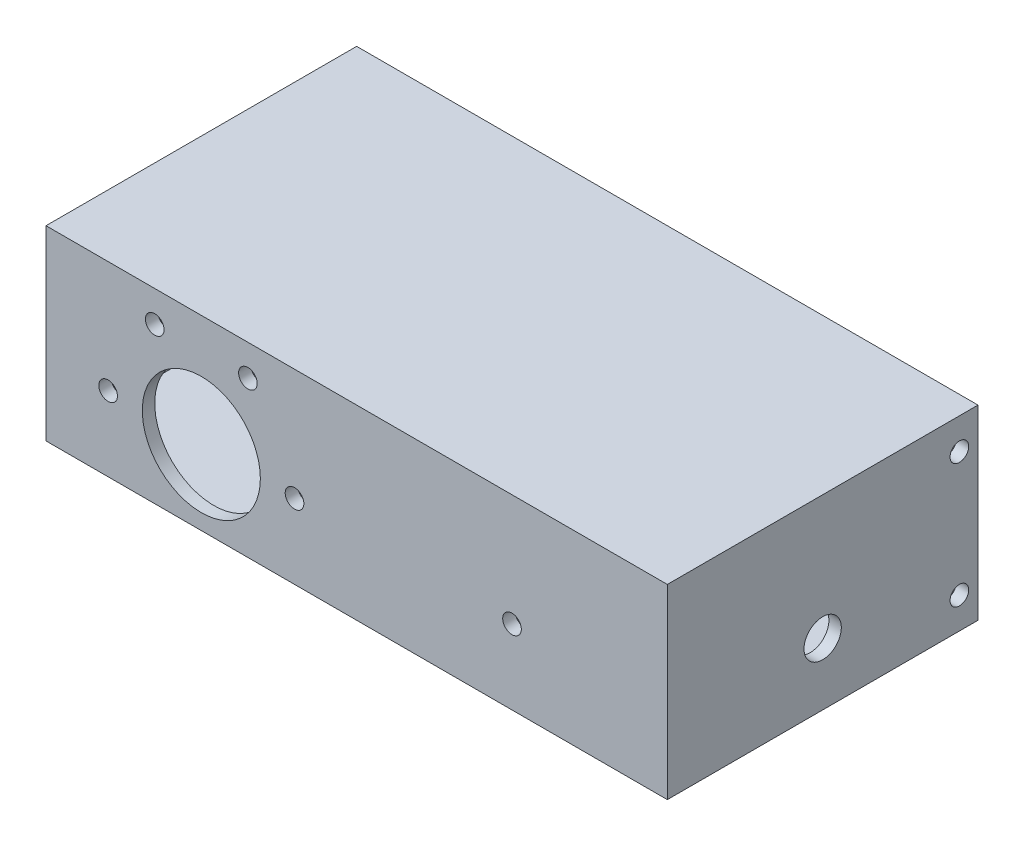
ISO-10303-21;
HEADER;
FILE_DESCRIPTION(('STEP AP214'),'2;1');
FILE_NAME('part.step','',(''),(''),'','','');
FILE_SCHEMA(('AUTOMOTIVE_DESIGN { 1 0 10303 214 1 1 1 1 }'));
ENDSEC;
DATA;
#1=APPLICATION_CONTEXT('core data for automotive mechanical design processes');
#2=APPLICATION_PROTOCOL_DEFINITION('international standard','automotive_design',2000,#1);
#3=PRODUCT_CONTEXT('',#1,'mechanical');
#4=PRODUCT('Part','Part','',(#3));
#5=PRODUCT_RELATED_PRODUCT_CATEGORY('part','',(#4));
#6=PRODUCT_DEFINITION_FORMATION('','',#4);
#7=PRODUCT_DEFINITION_CONTEXT('part definition',#1,'design');
#8=PRODUCT_DEFINITION('design','',#6,#7);
#9=PRODUCT_DEFINITION_SHAPE('','',#8);
#10=(LENGTH_UNIT() NAMED_UNIT(*) SI_UNIT(.MILLI.,.METRE.));
#11=(NAMED_UNIT(*) PLANE_ANGLE_UNIT() SI_UNIT($,.RADIAN.));
#12=(NAMED_UNIT(*) SI_UNIT($,.STERADIAN.) SOLID_ANGLE_UNIT());
#13=UNCERTAINTY_MEASURE_WITH_UNIT(LENGTH_MEASURE(1.E-05),#10,'distance_accuracy_value','');
#14=(GEOMETRIC_REPRESENTATION_CONTEXT(3) GLOBAL_UNCERTAINTY_ASSIGNED_CONTEXT((#13)) GLOBAL_UNIT_ASSIGNED_CONTEXT((#10,
#11,#12)) REPRESENTATION_CONTEXT('',''));
#15=CARTESIAN_POINT('',(0.,0.,0.));
#16=DIRECTION('',(0.,0.,1.));
#17=DIRECTION('',(1.,0.,0.));
#18=AXIS2_PLACEMENT_3D('',#15,#16,#17);
#19=CARTESIAN_POINT('',(0.,0.,0.));
#20=DIRECTION('',(0.,0.,-1.));
#21=DIRECTION('',(-1.,0.,0.));
#22=AXIS2_PLACEMENT_3D('',#19,#20,#21);
#23=PLANE('',#22);
#24=CARTESIAN_POINT('',(-10.,-3.00000000000011,0.));
#25=DIRECTION('',(0.,0.,1.));
#26=DIRECTION('',(1.,0.,0.));
#27=AXIS2_PLACEMENT_3D('',#24,#25,#26);
#28=CIRCLE('',#27,1.5);
#29=CARTESIAN_POINT('',(-8.5,-3.00000000000011,0.));
#30=VERTEX_POINT('',#29);
#31=EDGE_CURVE('E165',#30,#30,#28,.T.);
#32=ORIENTED_EDGE('',*,*,#31,.T.);
#33=EDGE_LOOP('',(#32));
#34=FACE_BOUND('',#33,.T.);
#35=CARTESIAN_POINT('',(-32.5,9.9903810567666,0.));
#36=DIRECTION('',(0.,0.,1.));
#37=DIRECTION('',(1.,0.,0.));
#38=AXIS2_PLACEMENT_3D('',#35,#36,#37);
#39=CIRCLE('',#38,1.5);
#40=CARTESIAN_POINT('',(-31.,9.9903810567666,0.));
#41=VERTEX_POINT('',#40);
#42=EDGE_CURVE('E184',#41,#41,#39,.T.);
#43=ORIENTED_EDGE('',*,*,#42,.T.);
#44=EDGE_LOOP('',(#43));
#45=FACE_BOUND('',#44,.T.);
#46=CARTESIAN_POINT('',(-25.,-3.,0.));
#47=DIRECTION('',(0.,0.,1.));
#48=DIRECTION('',(1.,0.,0.));
#49=AXIS2_PLACEMENT_3D('',#46,#47,#48);
#50=CIRCLE('',#49,9.5);
#51=CARTESIAN_POINT('',(-15.5,-3.,0.));
#52=VERTEX_POINT('',#51);
#53=EDGE_CURVE('E200',#52,#52,#50,.T.);
#54=ORIENTED_EDGE('',*,*,#53,.T.);
#55=EDGE_LOOP('',(#54));
#56=FACE_BOUND('',#55,.T.);
#57=CARTESIAN_POINT('',(-40.,-3.,0.));
#58=DIRECTION('',(0.,0.,1.));
#59=DIRECTION('',(1.,0.,0.));
#60=AXIS2_PLACEMENT_3D('',#57,#58,#59);
#61=CIRCLE('',#60,1.5);
#62=CARTESIAN_POINT('',(-38.5,-3.,0.));
#63=VERTEX_POINT('',#62);
#64=EDGE_CURVE('E208',#63,#63,#61,.T.);
#65=ORIENTED_EDGE('',*,*,#64,.T.);
#66=EDGE_LOOP('',(#65));
#67=FACE_BOUND('',#66,.T.);
#68=CARTESIAN_POINT('',(25.,-3.00000000000011,0.));
#69=DIRECTION('',(0.,0.,1.));
#70=DIRECTION('',(1.,0.,0.));
#71=AXIS2_PLACEMENT_3D('',#68,#69,#70);
#72=CIRCLE('',#71,1.5);
#73=CARTESIAN_POINT('',(26.5,-3.00000000000011,0.));
#74=VERTEX_POINT('',#73);
#75=EDGE_CURVE('E192',#74,#74,#72,.T.);
#76=ORIENTED_EDGE('',*,*,#75,.T.);
#77=EDGE_LOOP('',(#76));
#78=FACE_BOUND('',#77,.T.);
#79=CARTESIAN_POINT('',(-17.4999999999999,9.99038105676655,0.));
#80=DIRECTION('',(0.,0.,1.));
#81=DIRECTION('',(1.,0.,0.));
#82=AXIS2_PLACEMENT_3D('',#79,#80,#81);
#83=CIRCLE('',#82,1.50000000000001);
#84=CARTESIAN_POINT('',(-15.9999999999999,9.99038105676655,0.));
#85=VERTEX_POINT('',#84);
#86=EDGE_CURVE('E176',#85,#85,#83,.T.);
#87=ORIENTED_EDGE('',*,*,#86,.T.);
#88=EDGE_LOOP('',(#87));
#89=FACE_BOUND('',#88,.T.);
#90=DIRECTION('',(-1.,0.,0.));
#91=VECTOR('',#90,1.);
#92=CARTESIAN_POINT('',(0.,13.,0.));
#93=LINE('',#92,#91);
#94=CARTESIAN_POINT('',(48.,13.,0.));
#95=VERTEX_POINT('',#94);
#96=CARTESIAN_POINT('',(-48.,13.,0.));
#97=VERTEX_POINT('',#96);
#98=EDGE_CURVE('E51',#95,#97,#93,.T.);
#99=ORIENTED_EDGE('',*,*,#98,.F.);
#100=DIRECTION('',(0.,-1.,0.));
#101=VECTOR('',#100,1.);
#102=CARTESIAN_POINT('',(48.,0.,0.));
#103=LINE('',#102,#101);
#104=CARTESIAN_POINT('',(48.,-13.,0.));
#105=VERTEX_POINT('',#104);
#106=EDGE_CURVE('E11',#95,#105,#103,.T.);
#107=ORIENTED_EDGE('',*,*,#106,.T.);
#108=DIRECTION('',(-1.,0.,0.));
#109=VECTOR('',#108,1.);
#110=CARTESIAN_POINT('',(0.,-13.,0.));
#111=LINE('',#110,#109);
#112=CARTESIAN_POINT('',(-48.,-13.,0.));
#113=VERTEX_POINT('',#112);
#114=EDGE_CURVE('E125',#105,#113,#111,.T.);
#115=ORIENTED_EDGE('',*,*,#114,.T.);
#116=DIRECTION('',(0.,-1.,0.));
#117=VECTOR('',#116,1.);
#118=CARTESIAN_POINT('',(-48.,0.,0.));
#119=LINE('',#118,#117);
#120=EDGE_CURVE('E244',#97,#113,#119,.T.);
#121=ORIENTED_EDGE('',*,*,#120,.F.);
#122=EDGE_LOOP('',(#99,#107,#115,#121));
#123=FACE_BOUND('',#122,.T.);
#124=ADVANCED_FACE('F41',(#34,#45,#56,#67,#78,#89,#123),#23,.T.);
#125=CARTESIAN_POINT('',(0.,0.,2.));
#126=DIRECTION('',(0.,0.,-1.));
#127=DIRECTION('',(-1.,0.,0.));
#128=AXIS2_PLACEMENT_3D('',#125,#126,#127);
#129=PLANE('',#128);
#130=DIRECTION('',(0.,1.,0.));
#131=VECTOR('',#130,1.);
#132=CARTESIAN_POINT('',(50.,-15.,2.));
#133=LINE('',#132,#131);
#134=CARTESIAN_POINT('',(50.,-15.,2.));
#135=VERTEX_POINT('',#134);
#136=CARTESIAN_POINT('',(50.,15.,2.));
#137=VERTEX_POINT('',#136);
#138=EDGE_CURVE('E216',#135,#137,#133,.T.);
#139=ORIENTED_EDGE('',*,*,#138,.T.);
#140=DIRECTION('',(-1.,0.,0.));
#141=VECTOR('',#140,1.);
#142=CARTESIAN_POINT('',(-50.,15.,2.));
#143=LINE('',#142,#141);
#144=CARTESIAN_POINT('',(-50.,15.,2.));
#145=VERTEX_POINT('',#144);
#146=EDGE_CURVE('E222',#137,#145,#143,.T.);
#147=ORIENTED_EDGE('',*,*,#146,.T.);
#148=DIRECTION('',(0.,-1.,0.));
#149=VECTOR('',#148,1.);
#150=CARTESIAN_POINT('',(-50.,-15.,2.));
#151=LINE('',#150,#149);
#152=CARTESIAN_POINT('',(-50.,-15.,2.));
#153=VERTEX_POINT('',#152);
#154=EDGE_CURVE('E225',#145,#153,#151,.T.);
#155=ORIENTED_EDGE('',*,*,#154,.T.);
#156=DIRECTION('',(1.,0.,0.));
#157=VECTOR('',#156,1.);
#158=CARTESIAN_POINT('',(-50.,-15.,2.));
#159=LINE('',#158,#157);
#160=EDGE_CURVE('E67',#153,#135,#159,.T.);
#161=ORIENTED_EDGE('',*,*,#160,.T.);
#162=EDGE_LOOP('',(#139,#147,#155,#161));
#163=FACE_BOUND('',#162,.T.);
#164=CARTESIAN_POINT('',(-10.,-3.00000000000011,2.));
#165=DIRECTION('',(0.,0.,1.));
#166=DIRECTION('',(1.,0.,0.));
#167=AXIS2_PLACEMENT_3D('',#164,#165,#166);
#168=CIRCLE('',#167,1.5);
#169=CARTESIAN_POINT('',(-8.5,-3.00000000000011,2.));
#170=VERTEX_POINT('',#169);
#171=EDGE_CURVE('E172',#170,#170,#168,.T.);
#172=ORIENTED_EDGE('',*,*,#171,.F.);
#173=EDGE_LOOP('',(#172));
#174=FACE_BOUND('',#173,.T.);
#175=CARTESIAN_POINT('',(-17.4999999999999,9.99038105676655,2.));
#176=DIRECTION('',(0.,0.,1.));
#177=DIRECTION('',(1.,0.,0.));
#178=AXIS2_PLACEMENT_3D('',#175,#176,#177);
#179=CIRCLE('',#178,1.50000000000001);
#180=CARTESIAN_POINT('',(-15.9999999999999,9.99038105676655,2.));
#181=VERTEX_POINT('',#180);
#182=EDGE_CURVE('E180',#181,#181,#179,.T.);
#183=ORIENTED_EDGE('',*,*,#182,.F.);
#184=EDGE_LOOP('',(#183));
#185=FACE_BOUND('',#184,.T.);
#186=CARTESIAN_POINT('',(-32.5,9.9903810567666,2.));
#187=DIRECTION('',(0.,0.,1.));
#188=DIRECTION('',(1.,0.,0.));
#189=AXIS2_PLACEMENT_3D('',#186,#187,#188);
#190=CIRCLE('',#189,1.5);
#191=CARTESIAN_POINT('',(-31.,9.9903810567666,2.));
#192=VERTEX_POINT('',#191);
#193=EDGE_CURVE('E188',#192,#192,#190,.T.);
#194=ORIENTED_EDGE('',*,*,#193,.F.);
#195=EDGE_LOOP('',(#194));
#196=FACE_BOUND('',#195,.T.);
#197=CARTESIAN_POINT('',(25.,-3.00000000000011,2.));
#198=DIRECTION('',(0.,0.,1.));
#199=DIRECTION('',(1.,0.,0.));
#200=AXIS2_PLACEMENT_3D('',#197,#198,#199);
#201=CIRCLE('',#200,1.5);
#202=CARTESIAN_POINT('',(26.5,-3.00000000000011,2.));
#203=VERTEX_POINT('',#202);
#204=EDGE_CURVE('E196',#203,#203,#201,.T.);
#205=ORIENTED_EDGE('',*,*,#204,.F.);
#206=EDGE_LOOP('',(#205));
#207=FACE_BOUND('',#206,.T.);
#208=CARTESIAN_POINT('',(-25.,-3.,2.));
#209=DIRECTION('',(0.,0.,1.));
#210=DIRECTION('',(1.,0.,0.));
#211=AXIS2_PLACEMENT_3D('',#208,#209,#210);
#212=CIRCLE('',#211,9.5);
#213=CARTESIAN_POINT('',(-15.5,-3.,2.));
#214=VERTEX_POINT('',#213);
#215=EDGE_CURVE('E204',#214,#214,#212,.T.);
#216=ORIENTED_EDGE('',*,*,#215,.F.);
#217=EDGE_LOOP('',(#216));
#218=FACE_BOUND('',#217,.T.);
#219=CARTESIAN_POINT('',(-40.,-3.,2.));
#220=DIRECTION('',(0.,0.,1.));
#221=DIRECTION('',(1.,0.,0.));
#222=AXIS2_PLACEMENT_3D('',#219,#220,#221);
#223=CIRCLE('',#222,1.5);
#224=CARTESIAN_POINT('',(-38.5,-3.,2.));
#225=VERTEX_POINT('',#224);
#226=EDGE_CURVE('E212',#225,#225,#223,.T.);
#227=ORIENTED_EDGE('',*,*,#226,.F.);
#228=EDGE_LOOP('',(#227));
#229=FACE_BOUND('',#228,.T.);
#230=ADVANCED_FACE('F328',(#163,#174,#185,#196,#207,#218,#229),#129,.F.);
#231=CARTESIAN_POINT('',(50.,-15.,2.));
#232=DIRECTION('',(-1.,0.,0.));
#233=DIRECTION('',(0.,0.,1.));
#234=AXIS2_PLACEMENT_3D('',#231,#232,#233);
#235=PLANE('',#234);
#236=CARTESIAN_POINT('',(50.,-5.,-23.));
#237=DIRECTION('',(-1.,0.,0.));
#238=DIRECTION('',(0.,0.,1.));
#239=AXIS2_PLACEMENT_3D('',#236,#237,#238);
#240=CIRCLE('',#239,3.);
#241=CARTESIAN_POINT('',(50.,-5.,-20.));
#242=VERTEX_POINT('',#241);
#243=EDGE_CURVE('E292',#242,#242,#240,.T.);
#244=ORIENTED_EDGE('',*,*,#243,.T.);
#245=EDGE_LOOP('',(#244));
#246=FACE_BOUND('',#245,.T.);
#247=CARTESIAN_POINT('',(50.,10.,-45.));
#248=DIRECTION('',(-1.,0.,0.));
#249=DIRECTION('',(0.,0.,1.));
#250=AXIS2_PLACEMENT_3D('',#247,#248,#249);
#251=CIRCLE('',#250,1.5);
#252=CARTESIAN_POINT('',(50.,10.,-43.5));
#253=VERTEX_POINT('',#252);
#254=EDGE_CURVE('E253',#253,#253,#251,.T.);
#255=ORIENTED_EDGE('',*,*,#254,.T.);
#256=EDGE_LOOP('',(#255));
#257=FACE_BOUND('',#256,.T.);
#258=CARTESIAN_POINT('',(50.,-10.,-45.));
#259=DIRECTION('',(-1.,0.,0.));
#260=DIRECTION('',(0.,0.,1.));
#261=AXIS2_PLACEMENT_3D('',#258,#259,#260);
#262=CIRCLE('',#261,1.5);
#263=CARTESIAN_POINT('',(50.,-10.,-43.5));
#264=VERTEX_POINT('',#263);
#265=EDGE_CURVE('E273',#264,#264,#262,.T.);
#266=ORIENTED_EDGE('',*,*,#265,.T.);
#267=EDGE_LOOP('',(#266));
#268=FACE_BOUND('',#267,.T.);
#269=DIRECTION('',(0.,0.,-1.));
#270=VECTOR('',#269,1.);
#271=CARTESIAN_POINT('',(50.,-15.,2.));
#272=LINE('',#271,#270);
#273=CARTESIAN_POINT('',(50.,-15.,-48.));
#274=VERTEX_POINT('',#273);
#275=EDGE_CURVE('E230',#135,#274,#272,.T.);
#276=ORIENTED_EDGE('',*,*,#275,.T.);
#277=DIRECTION('',(0.,1.,0.));
#278=VECTOR('',#277,1.);
#279=CARTESIAN_POINT('',(50.,0.,-48.));
#280=LINE('',#279,#278);
#281=CARTESIAN_POINT('',(50.,15.,-48.));
#282=VERTEX_POINT('',#281);
#283=EDGE_CURVE('E152',#274,#282,#280,.T.);
#284=ORIENTED_EDGE('',*,*,#283,.T.);
#285=DIRECTION('',(0.,0.,-1.));
#286=VECTOR('',#285,1.);
#287=CARTESIAN_POINT('',(50.,15.,2.));
#288=LINE('',#287,#286);
#289=EDGE_CURVE('E239',#137,#282,#288,.T.);
#290=ORIENTED_EDGE('',*,*,#289,.F.);
#291=ORIENTED_EDGE('',*,*,#138,.F.);
#292=EDGE_LOOP('',(#276,#284,#290,#291));
#293=FACE_BOUND('',#292,.T.);
#294=ADVANCED_FACE('F43',(#246,#257,#268,#293),#235,.F.);
#295=CARTESIAN_POINT('',(-50.,15.,2.));
#296=DIRECTION('',(0.,-1.,0.));
#297=DIRECTION('',(0.,0.,-1.));
#298=AXIS2_PLACEMENT_3D('',#295,#296,#297);
#299=PLANE('',#298);
#300=ORIENTED_EDGE('',*,*,#289,.T.);
#301=DIRECTION('',(-1.,0.,0.));
#302=VECTOR('',#301,1.);
#303=CARTESIAN_POINT('',(0.,15.,-48.));
#304=LINE('',#303,#302);
#305=CARTESIAN_POINT('',(-50.,15.,-48.));
#306=VERTEX_POINT('',#305);
#307=EDGE_CURVE('E156',#282,#306,#304,.T.);
#308=ORIENTED_EDGE('',*,*,#307,.T.);
#309=DIRECTION('',(0.,0.,-1.));
#310=VECTOR('',#309,1.);
#311=CARTESIAN_POINT('',(-50.,15.,2.));
#312=LINE('',#311,#310);
#313=EDGE_CURVE('E236',#145,#306,#312,.T.);
#314=ORIENTED_EDGE('',*,*,#313,.F.);
#315=ORIENTED_EDGE('',*,*,#146,.F.);
#316=EDGE_LOOP('',(#300,#308,#314,#315));
#317=FACE_BOUND('',#316,.T.);
#318=ADVANCED_FACE('F345',(#317),#299,.F.);
#319=CARTESIAN_POINT('',(-50.,-15.,2.));
#320=DIRECTION('',(1.,0.,0.));
#321=DIRECTION('',(0.,0.,-1.));
#322=AXIS2_PLACEMENT_3D('',#319,#320,#321);
#323=PLANE('',#322);
#324=CARTESIAN_POINT('',(-50.,-5.,-23.));
#325=DIRECTION('',(-1.,0.,0.));
#326=DIRECTION('',(0.,0.,1.));
#327=AXIS2_PLACEMENT_3D('',#324,#325,#326);
#328=CIRCLE('',#327,3.);
#329=CARTESIAN_POINT('',(-50.,-5.,-20.));
#330=VERTEX_POINT('',#329);
#331=EDGE_CURVE('E288',#330,#330,#328,.T.);
#332=ORIENTED_EDGE('',*,*,#331,.F.);
#333=EDGE_LOOP('',(#332));
#334=FACE_BOUND('',#333,.T.);
#335=CARTESIAN_POINT('',(-50.,10.,-45.));
#336=DIRECTION('',(-1.,0.,0.));
#337=DIRECTION('',(0.,0.,1.));
#338=AXIS2_PLACEMENT_3D('',#335,#336,#337);
#339=CIRCLE('',#338,1.5);
#340=CARTESIAN_POINT('',(-50.,10.,-43.5));
#341=VERTEX_POINT('',#340);
#342=EDGE_CURVE('E278',#341,#341,#339,.T.);
#343=ORIENTED_EDGE('',*,*,#342,.F.);
#344=EDGE_LOOP('',(#343));
#345=FACE_BOUND('',#344,.T.);
#346=CARTESIAN_POINT('',(-50.,-10.,-45.));
#347=DIRECTION('',(-1.,0.,0.));
#348=DIRECTION('',(0.,0.,1.));
#349=AXIS2_PLACEMENT_3D('',#346,#347,#348);
#350=CIRCLE('',#349,1.5);
#351=CARTESIAN_POINT('',(-50.,-10.,-43.5));
#352=VERTEX_POINT('',#351);
#353=EDGE_CURVE('E269',#352,#352,#350,.T.);
#354=ORIENTED_EDGE('',*,*,#353,.F.);
#355=EDGE_LOOP('',(#354));
#356=FACE_BOUND('',#355,.T.);
#357=CARTESIAN_POINT('',(-50.,2.99999999999999,-38.));
#358=DIRECTION('',(-1.,0.,0.));
#359=DIRECTION('',(0.,0.,1.));
#360=AXIS2_PLACEMENT_3D('',#357,#358,#359);
#361=CIRCLE('',#360,5.);
#362=CARTESIAN_POINT('',(-50.,2.99999999999999,-33.));
#363=VERTEX_POINT('',#362);
#364=EDGE_CURVE('E139',#363,#363,#361,.T.);
#365=ORIENTED_EDGE('',*,*,#364,.F.);
#366=EDGE_LOOP('',(#365));
#367=FACE_BOUND('',#366,.T.);
#368=ORIENTED_EDGE('',*,*,#313,.T.);
#369=DIRECTION('',(0.,-1.,0.));
#370=VECTOR('',#369,1.);
#371=CARTESIAN_POINT('',(-50.,0.,-48.));
#372=LINE('',#371,#370);
#373=CARTESIAN_POINT('',(-50.,-15.,-48.));
#374=VERTEX_POINT('',#373);
#375=EDGE_CURVE('E128',#306,#374,#372,.T.);
#376=ORIENTED_EDGE('',*,*,#375,.T.);
#377=DIRECTION('',(0.,0.,-1.));
#378=VECTOR('',#377,1.);
#379=CARTESIAN_POINT('',(-50.,-15.,2.));
#380=LINE('',#379,#378);
#381=EDGE_CURVE('E233',#153,#374,#380,.T.);
#382=ORIENTED_EDGE('',*,*,#381,.F.);
#383=ORIENTED_EDGE('',*,*,#154,.F.);
#384=EDGE_LOOP('',(#368,#376,#382,#383));
#385=FACE_BOUND('',#384,.T.);
#386=ADVANCED_FACE('F342',(#334,#345,#356,#367,#385),#323,.F.);
#387=CARTESIAN_POINT('',(-50.,-15.,2.));
#388=DIRECTION('',(0.,1.,0.));
#389=DIRECTION('',(0.,0.,1.));
#390=AXIS2_PLACEMENT_3D('',#387,#388,#389);
#391=PLANE('',#390);
#392=ORIENTED_EDGE('',*,*,#381,.T.);
#393=DIRECTION('',(1.,0.,0.));
#394=VECTOR('',#393,1.);
#395=CARTESIAN_POINT('',(0.,-15.,-48.));
#396=LINE('',#395,#394);
#397=EDGE_CURVE('E148',#374,#274,#396,.T.);
#398=ORIENTED_EDGE('',*,*,#397,.T.);
#399=ORIENTED_EDGE('',*,*,#275,.F.);
#400=ORIENTED_EDGE('',*,*,#160,.F.);
#401=EDGE_LOOP('',(#392,#398,#399,#400));
#402=FACE_BOUND('',#401,.T.);
#403=ADVANCED_FACE('F338',(#402),#391,.F.);
#404=CARTESIAN_POINT('',(-40.,-3.,2.));
#405=DIRECTION('',(0.,0.,-1.));
#406=DIRECTION('',(-1.,0.,0.));
#407=AXIS2_PLACEMENT_3D('',#404,#405,#406);
#408=CYLINDRICAL_SURFACE('',#407,1.5);
#409=ORIENTED_EDGE('',*,*,#226,.T.);
#410=EDGE_LOOP('',(#409));
#411=FACE_BOUND('',#410,.T.);
#412=ORIENTED_EDGE('',*,*,#64,.F.);
#413=EDGE_LOOP('',(#412));
#414=FACE_BOUND('',#413,.T.);
#415=ADVANCED_FACE('F341',(#411,#414),#408,.F.);
#416=CARTESIAN_POINT('',(-25.,-3.,2.));
#417=DIRECTION('',(0.,0.,-1.));
#418=DIRECTION('',(-1.,0.,0.));
#419=AXIS2_PLACEMENT_3D('',#416,#417,#418);
#420=CYLINDRICAL_SURFACE('',#419,9.5);
#421=ORIENTED_EDGE('',*,*,#215,.T.);
#422=EDGE_LOOP('',(#421));
#423=FACE_BOUND('',#422,.T.);
#424=ORIENTED_EDGE('',*,*,#53,.F.);
#425=EDGE_LOOP('',(#424));
#426=FACE_BOUND('',#425,.T.);
#427=ADVANCED_FACE('F378',(#423,#426),#420,.F.);
#428=CARTESIAN_POINT('',(25.,-3.00000000000011,2.));
#429=DIRECTION('',(0.,0.,-1.));
#430=DIRECTION('',(-1.,0.,0.));
#431=AXIS2_PLACEMENT_3D('',#428,#429,#430);
#432=CYLINDRICAL_SURFACE('',#431,1.5);
#433=ORIENTED_EDGE('',*,*,#204,.T.);
#434=EDGE_LOOP('',(#433));
#435=FACE_BOUND('',#434,.T.);
#436=ORIENTED_EDGE('',*,*,#75,.F.);
#437=EDGE_LOOP('',(#436));
#438=FACE_BOUND('',#437,.T.);
#439=ADVANCED_FACE('F397',(#435,#438),#432,.F.);
#440=CARTESIAN_POINT('',(-32.5,9.9903810567666,2.));
#441=DIRECTION('',(0.,0.,-1.));
#442=DIRECTION('',(-1.,0.,0.));
#443=AXIS2_PLACEMENT_3D('',#440,#441,#442);
#444=CYLINDRICAL_SURFACE('',#443,1.5);
#445=ORIENTED_EDGE('',*,*,#193,.T.);
#446=EDGE_LOOP('',(#445));
#447=FACE_BOUND('',#446,.T.);
#448=ORIENTED_EDGE('',*,*,#42,.F.);
#449=EDGE_LOOP('',(#448));
#450=FACE_BOUND('',#449,.T.);
#451=ADVANCED_FACE('F388',(#447,#450),#444,.F.);
#452=CARTESIAN_POINT('',(-17.4999999999999,9.99038105676655,2.));
#453=DIRECTION('',(0.,0.,-1.));
#454=DIRECTION('',(-1.,0.,0.));
#455=AXIS2_PLACEMENT_3D('',#452,#453,#454);
#456=CYLINDRICAL_SURFACE('',#455,1.50000000000001);
#457=ORIENTED_EDGE('',*,*,#182,.T.);
#458=EDGE_LOOP('',(#457));
#459=FACE_BOUND('',#458,.T.);
#460=ORIENTED_EDGE('',*,*,#86,.F.);
#461=EDGE_LOOP('',(#460));
#462=FACE_BOUND('',#461,.T.);
#463=ADVANCED_FACE('F386',(#459,#462),#456,.F.);
#464=CARTESIAN_POINT('',(-10.,-3.00000000000011,2.));
#465=DIRECTION('',(0.,0.,-1.));
#466=DIRECTION('',(-1.,0.,0.));
#467=AXIS2_PLACEMENT_3D('',#464,#465,#466);
#468=CYLINDRICAL_SURFACE('',#467,1.5);
#469=ORIENTED_EDGE('',*,*,#171,.T.);
#470=EDGE_LOOP('',(#469));
#471=FACE_BOUND('',#470,.T.);
#472=ORIENTED_EDGE('',*,*,#31,.F.);
#473=EDGE_LOOP('',(#472));
#474=FACE_BOUND('',#473,.T.);
#475=ADVANCED_FACE('F323',(#471,#474),#468,.F.);
#476=CARTESIAN_POINT('',(48.,0.,-48.));
#477=DIRECTION('',(1.,0.,0.));
#478=DIRECTION('',(0.,0.,-1.));
#479=AXIS2_PLACEMENT_3D('',#476,#477,#478);
#480=PLANE('',#479);
#481=CARTESIAN_POINT('',(48.,-5.,-23.));
#482=DIRECTION('',(1.,0.,0.));
#483=DIRECTION('',(0.,0.,-1.));
#484=AXIS2_PLACEMENT_3D('',#481,#482,#483);
#485=CIRCLE('',#484,3.);
#486=CARTESIAN_POINT('',(48.,-5.,-26.));
#487=VERTEX_POINT('',#486);
#488=EDGE_CURVE('E274',#487,#487,#485,.T.);
#489=ORIENTED_EDGE('',*,*,#488,.T.);
#490=EDGE_LOOP('',(#489));
#491=FACE_BOUND('',#490,.T.);
#492=CARTESIAN_POINT('',(48.,10.,-45.));
#493=DIRECTION('',(1.,0.,0.));
#494=DIRECTION('',(0.,0.,-1.));
#495=AXIS2_PLACEMENT_3D('',#492,#493,#494);
#496=CIRCLE('',#495,1.5);
#497=CARTESIAN_POINT('',(48.,10.,-46.5));
#498=VERTEX_POINT('',#497);
#499=EDGE_CURVE('E257',#498,#498,#496,.T.);
#500=ORIENTED_EDGE('',*,*,#499,.T.);
#501=EDGE_LOOP('',(#500));
#502=FACE_BOUND('',#501,.T.);
#503=CARTESIAN_POINT('',(48.,-10.,-45.));
#504=DIRECTION('',(1.,0.,0.));
#505=DIRECTION('',(0.,0.,-1.));
#506=AXIS2_PLACEMENT_3D('',#503,#504,#505);
#507=CIRCLE('',#506,1.5);
#508=CARTESIAN_POINT('',(48.,-10.,-46.5));
#509=VERTEX_POINT('',#508);
#510=EDGE_CURVE('E252',#509,#509,#507,.T.);
#511=ORIENTED_EDGE('',*,*,#510,.T.);
#512=EDGE_LOOP('',(#511));
#513=FACE_BOUND('',#512,.T.);
#514=ORIENTED_EDGE('',*,*,#106,.F.);
#515=DIRECTION('',(0.,0.,1.));
#516=VECTOR('',#515,1.);
#517=CARTESIAN_POINT('',(48.,13.,-48.));
#518=LINE('',#517,#516);
#519=CARTESIAN_POINT('',(48.,13.,-48.));
#520=VERTEX_POINT('',#519);
#521=EDGE_CURVE('E132',#520,#95,#518,.T.);
#522=ORIENTED_EDGE('',*,*,#521,.F.);
#523=DIRECTION('',(0.,1.,0.));
#524=VECTOR('',#523,1.);
#525=CARTESIAN_POINT('',(48.,0.,-48.));
#526=LINE('',#525,#524);
#527=CARTESIAN_POINT('',(48.,-13.,-48.));
#528=VERTEX_POINT('',#527);
#529=EDGE_CURVE('E115',#528,#520,#526,.T.);
#530=ORIENTED_EDGE('',*,*,#529,.F.);
#531=DIRECTION('',(0.,0.,1.));
#532=VECTOR('',#531,1.);
#533=CARTESIAN_POINT('',(48.,-13.,-48.));
#534=LINE('',#533,#532);
#535=EDGE_CURVE('E122',#528,#105,#534,.T.);
#536=ORIENTED_EDGE('',*,*,#535,.T.);
#537=EDGE_LOOP('',(#514,#522,#530,#536));
#538=FACE_BOUND('',#537,.T.);
#539=ADVANCED_FACE('F130',(#491,#502,#513,#538),#480,.F.);
#540=CARTESIAN_POINT('',(0.,13.,-48.));
#541=DIRECTION('',(0.,-1.,0.));
#542=DIRECTION('',(0.,0.,-1.));
#543=AXIS2_PLACEMENT_3D('',#540,#541,#542);
#544=PLANE('',#543);
#545=ORIENTED_EDGE('',*,*,#521,.T.);
#546=ORIENTED_EDGE('',*,*,#98,.T.);
#547=DIRECTION('',(0.,0.,1.));
#548=VECTOR('',#547,1.);
#549=CARTESIAN_POINT('',(-48.,13.,-48.));
#550=LINE('',#549,#548);
#551=CARTESIAN_POINT('',(-48.,13.,-48.));
#552=VERTEX_POINT('',#551);
#553=EDGE_CURVE('E166',#552,#97,#550,.T.);
#554=ORIENTED_EDGE('',*,*,#553,.F.);
#555=DIRECTION('',(1.,0.,0.));
#556=VECTOR('',#555,1.);
#557=CARTESIAN_POINT('',(0.,13.,-48.));
#558=LINE('',#557,#556);
#559=EDGE_CURVE('E145',#552,#520,#558,.T.);
#560=ORIENTED_EDGE('',*,*,#559,.T.);
#561=EDGE_LOOP('',(#545,#546,#554,#560));
#562=FACE_BOUND('',#561,.T.);
#563=ADVANCED_FACE('F307',(#562),#544,.T.);
#564=CARTESIAN_POINT('',(-48.,0.,-48.));
#565=DIRECTION('',(1.,0.,0.));
#566=DIRECTION('',(0.,0.,-1.));
#567=AXIS2_PLACEMENT_3D('',#564,#565,#566);
#568=PLANE('',#567);
#569=CARTESIAN_POINT('',(-48.,-5.,-23.));
#570=DIRECTION('',(1.,0.,0.));
#571=DIRECTION('',(0.,0.,-1.));
#572=AXIS2_PLACEMENT_3D('',#569,#570,#571);
#573=CIRCLE('',#572,3.);
#574=CARTESIAN_POINT('',(-48.,-5.,-26.));
#575=VERTEX_POINT('',#574);
#576=EDGE_CURVE('E45',#575,#575,#573,.T.);
#577=ORIENTED_EDGE('',*,*,#576,.F.);
#578=EDGE_LOOP('',(#577));
#579=FACE_BOUND('',#578,.T.);
#580=CARTESIAN_POINT('',(-48.,10.,-45.));
#581=DIRECTION('',(1.,0.,0.));
#582=DIRECTION('',(0.,0.,-1.));
#583=AXIS2_PLACEMENT_3D('',#580,#581,#582);
#584=CIRCLE('',#583,1.5);
#585=CARTESIAN_POINT('',(-48.,10.,-46.5));
#586=VERTEX_POINT('',#585);
#587=EDGE_CURVE('E254',#586,#586,#584,.T.);
#588=ORIENTED_EDGE('',*,*,#587,.F.);
#589=EDGE_LOOP('',(#588));
#590=FACE_BOUND('',#589,.T.);
#591=CARTESIAN_POINT('',(-48.,-10.,-45.));
#592=DIRECTION('',(1.,0.,0.));
#593=DIRECTION('',(0.,0.,-1.));
#594=AXIS2_PLACEMENT_3D('',#591,#592,#593);
#595=CIRCLE('',#594,1.5);
#596=CARTESIAN_POINT('',(-48.,-10.,-46.5));
#597=VERTEX_POINT('',#596);
#598=EDGE_CURVE('E249',#597,#597,#595,.T.);
#599=ORIENTED_EDGE('',*,*,#598,.F.);
#600=EDGE_LOOP('',(#599));
#601=FACE_BOUND('',#600,.T.);
#602=CARTESIAN_POINT('',(-48.,2.99999999999999,-38.));
#603=DIRECTION('',(1.,0.,0.));
#604=DIRECTION('',(0.,0.,-1.));
#605=AXIS2_PLACEMENT_3D('',#602,#603,#604);
#606=CIRCLE('',#605,5.);
#607=CARTESIAN_POINT('',(-48.,2.99999999999999,-43.));
#608=VERTEX_POINT('',#607);
#609=EDGE_CURVE('E135',#608,#608,#606,.F.);
#610=ORIENTED_EDGE('',*,*,#609,.T.);
#611=EDGE_LOOP('',(#610));
#612=FACE_BOUND('',#611,.T.);
#613=ORIENTED_EDGE('',*,*,#553,.T.);
#614=ORIENTED_EDGE('',*,*,#120,.T.);
#615=DIRECTION('',(0.,0.,1.));
#616=VECTOR('',#615,1.);
#617=CARTESIAN_POINT('',(-48.,-13.,-48.));
#618=LINE('',#617,#616);
#619=CARTESIAN_POINT('',(-48.,-13.,-48.));
#620=VERTEX_POINT('',#619);
#621=EDGE_CURVE('E59',#620,#113,#618,.T.);
#622=ORIENTED_EDGE('',*,*,#621,.F.);
#623=DIRECTION('',(0.,1.,0.));
#624=VECTOR('',#623,1.);
#625=CARTESIAN_POINT('',(-48.,0.,-48.));
#626=LINE('',#625,#624);
#627=EDGE_CURVE('E118',#620,#552,#626,.T.);
#628=ORIENTED_EDGE('',*,*,#627,.T.);
#629=EDGE_LOOP('',(#613,#614,#622,#628));
#630=FACE_BOUND('',#629,.T.);
#631=ADVANCED_FACE('F304',(#579,#590,#601,#612,#630),#568,.T.);
#632=CARTESIAN_POINT('',(0.,-13.,-48.));
#633=DIRECTION('',(0.,-1.,0.));
#634=DIRECTION('',(0.,0.,-1.));
#635=AXIS2_PLACEMENT_3D('',#632,#633,#634);
#636=PLANE('',#635);
#637=ORIENTED_EDGE('',*,*,#114,.F.);
#638=ORIENTED_EDGE('',*,*,#535,.F.);
#639=DIRECTION('',(1.,0.,0.));
#640=VECTOR('',#639,1.);
#641=CARTESIAN_POINT('',(0.,-13.,-48.));
#642=LINE('',#641,#640);
#643=EDGE_CURVE('E109',#620,#528,#642,.T.);
#644=ORIENTED_EDGE('',*,*,#643,.F.);
#645=ORIENTED_EDGE('',*,*,#621,.T.);
#646=EDGE_LOOP('',(#637,#638,#644,#645));
#647=FACE_BOUND('',#646,.T.);
#648=ADVANCED_FACE('F123',(#647),#636,.F.);
#649=CARTESIAN_POINT('',(0.,0.,-48.));
#650=DIRECTION('',(0.,0.,1.));
#651=DIRECTION('',(1.,0.,0.));
#652=AXIS2_PLACEMENT_3D('',#649,#650,#651);
#653=PLANE('',#652);
#654=ORIENTED_EDGE('',*,*,#529,.T.);
#655=ORIENTED_EDGE('',*,*,#559,.F.);
#656=ORIENTED_EDGE('',*,*,#627,.F.);
#657=ORIENTED_EDGE('',*,*,#643,.T.);
#658=EDGE_LOOP('',(#654,#655,#656,#657));
#659=FACE_BOUND('',#658,.T.);
#660=ORIENTED_EDGE('',*,*,#397,.F.);
#661=ORIENTED_EDGE('',*,*,#375,.F.);
#662=ORIENTED_EDGE('',*,*,#307,.F.);
#663=ORIENTED_EDGE('',*,*,#283,.F.);
#664=EDGE_LOOP('',(#660,#661,#662,#663));
#665=FACE_BOUND('',#664,.T.);
#666=ADVANCED_FACE('F111',(#659,#665),#653,.F.);
#667=CARTESIAN_POINT('',(50.001,2.99999999999999,-38.));
#668=DIRECTION('',(-1.,0.,0.));
#669=DIRECTION('',(0.,0.,1.));
#670=AXIS2_PLACEMENT_3D('',#667,#668,#669);
#671=CYLINDRICAL_SURFACE('',#670,5.);
#672=ORIENTED_EDGE('',*,*,#609,.F.);
#673=EDGE_LOOP('',(#672));
#674=FACE_BOUND('',#673,.T.);
#675=ORIENTED_EDGE('',*,*,#364,.T.);
#676=EDGE_LOOP('',(#675));
#677=FACE_BOUND('',#676,.T.);
#678=ADVANCED_FACE('F479',(#674,#677),#671,.F.);
#679=CARTESIAN_POINT('',(50.,-10.,-45.));
#680=DIRECTION('',(-1.,0.,0.));
#681=DIRECTION('',(0.,0.,1.));
#682=AXIS2_PLACEMENT_3D('',#679,#680,#681);
#683=CYLINDRICAL_SURFACE('',#682,1.5);
#684=ORIENTED_EDGE('',*,*,#598,.T.);
#685=EDGE_LOOP('',(#684));
#686=FACE_BOUND('',#685,.T.);
#687=ORIENTED_EDGE('',*,*,#353,.T.);
#688=EDGE_LOOP('',(#687));
#689=FACE_BOUND('',#688,.T.);
#690=ADVANCED_FACE('F487',(#686,#689),#683,.F.);
#691=CARTESIAN_POINT('',(50.,10.,-45.));
#692=DIRECTION('',(-1.,0.,0.));
#693=DIRECTION('',(0.,0.,1.));
#694=AXIS2_PLACEMENT_3D('',#691,#692,#693);
#695=CYLINDRICAL_SURFACE('',#694,1.5);
#696=ORIENTED_EDGE('',*,*,#587,.T.);
#697=EDGE_LOOP('',(#696));
#698=FACE_BOUND('',#697,.T.);
#699=ORIENTED_EDGE('',*,*,#342,.T.);
#700=EDGE_LOOP('',(#699));
#701=FACE_BOUND('',#700,.T.);
#702=ADVANCED_FACE('F497',(#698,#701),#695,.F.);
#703=ORIENTED_EDGE('',*,*,#265,.F.);
#704=EDGE_LOOP('',(#703));
#705=FACE_BOUND('',#704,.T.);
#706=ORIENTED_EDGE('',*,*,#510,.F.);
#707=EDGE_LOOP('',(#706));
#708=FACE_BOUND('',#707,.T.);
#709=ADVANCED_FACE('F500',(#705,#708),#683,.F.);
#710=ORIENTED_EDGE('',*,*,#254,.F.);
#711=EDGE_LOOP('',(#710));
#712=FACE_BOUND('',#711,.T.);
#713=ORIENTED_EDGE('',*,*,#499,.F.);
#714=EDGE_LOOP('',(#713));
#715=FACE_BOUND('',#714,.T.);
#716=ADVANCED_FACE('F509',(#712,#715),#695,.F.);
#717=CARTESIAN_POINT('',(50.,-5.,-23.));
#718=DIRECTION('',(-1.,0.,0.));
#719=DIRECTION('',(0.,0.,1.));
#720=AXIS2_PLACEMENT_3D('',#717,#718,#719);
#721=CYLINDRICAL_SURFACE('',#720,3.);
#722=ORIENTED_EDGE('',*,*,#576,.T.);
#723=EDGE_LOOP('',(#722));
#724=FACE_BOUND('',#723,.T.);
#725=ORIENTED_EDGE('',*,*,#331,.T.);
#726=EDGE_LOOP('',(#725));
#727=FACE_BOUND('',#726,.T.);
#728=ADVANCED_FACE('F301',(#724,#727),#721,.F.);
#729=ORIENTED_EDGE('',*,*,#243,.F.);
#730=EDGE_LOOP('',(#729));
#731=FACE_BOUND('',#730,.T.);
#732=ORIENTED_EDGE('',*,*,#488,.F.);
#733=EDGE_LOOP('',(#732));
#734=FACE_BOUND('',#733,.T.);
#735=ADVANCED_FACE('F555',(#731,#734),#721,.F.);
#736=CLOSED_SHELL('',(#124,#230,#294,#318,#386,#403,#415,#427,#439,#451,#463,#475,#539,#563,
#631,#648,#666,#678,#690,#702,#709,#716,#728,#735));
#737=MANIFOLD_SOLID_BREP('B2',#736);
#738=ADVANCED_BREP_SHAPE_REPRESENTATION('',(#18,#737),#14);
#739=SHAPE_DEFINITION_REPRESENTATION(#9,#738);
ENDSEC;
END-ISO-10303-21;
